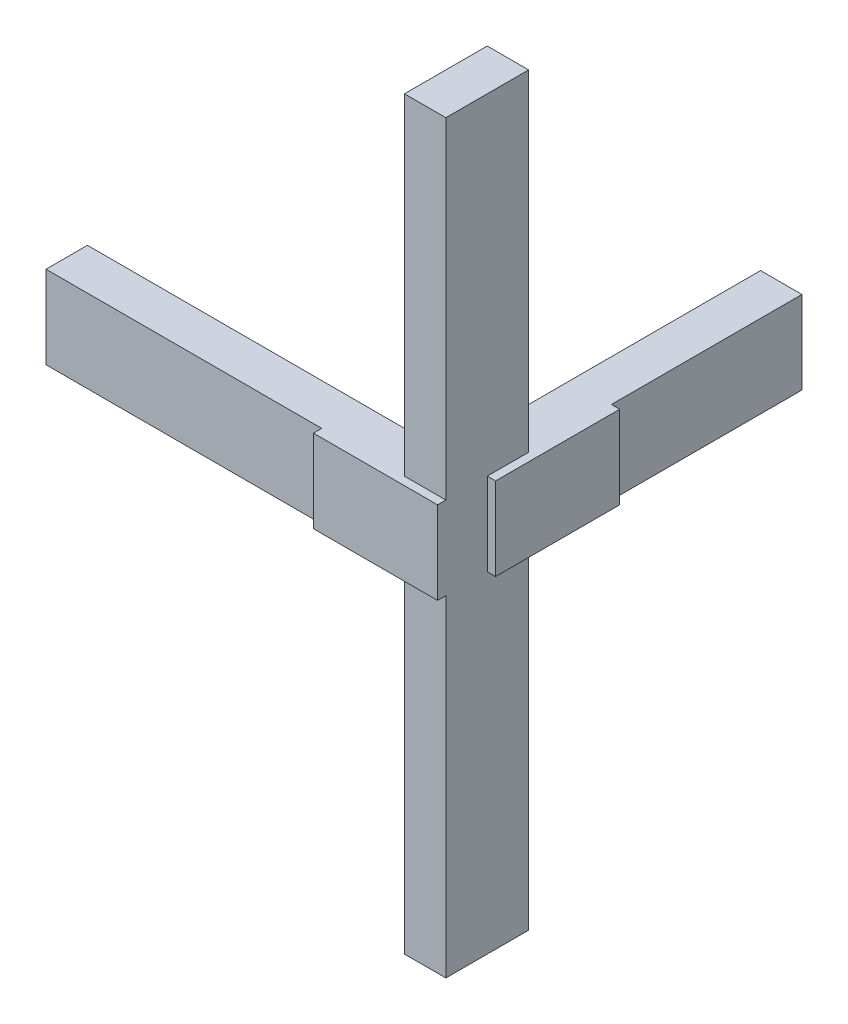
ISO-10303-21;
HEADER;
FILE_DESCRIPTION(('STEP AP214'),'2;1');
FILE_NAME('part.step','',(''),(''),'','','');
FILE_SCHEMA(('AUTOMOTIVE_DESIGN { 1 0 10303 214 1 1 1 1 }'));
ENDSEC;
DATA;
#1=APPLICATION_CONTEXT('core data for automotive mechanical design processes');
#2=APPLICATION_PROTOCOL_DEFINITION('international standard','automotive_design',2000,#1);
#3=PRODUCT_CONTEXT('',#1,'mechanical');
#4=PRODUCT('Part','Part','',(#3));
#5=PRODUCT_RELATED_PRODUCT_CATEGORY('part','',(#4));
#6=PRODUCT_DEFINITION_FORMATION('','',#4);
#7=PRODUCT_DEFINITION_CONTEXT('part definition',#1,'design');
#8=PRODUCT_DEFINITION('design','',#6,#7);
#9=PRODUCT_DEFINITION_SHAPE('','',#8);
#10=(LENGTH_UNIT() NAMED_UNIT(*) SI_UNIT(.MILLI.,.METRE.));
#11=(NAMED_UNIT(*) PLANE_ANGLE_UNIT() SI_UNIT($,.RADIAN.));
#12=(NAMED_UNIT(*) SI_UNIT($,.STERADIAN.) SOLID_ANGLE_UNIT());
#13=UNCERTAINTY_MEASURE_WITH_UNIT(LENGTH_MEASURE(1.E-05),#10,'distance_accuracy_value','');
#14=(GEOMETRIC_REPRESENTATION_CONTEXT(3) GLOBAL_UNCERTAINTY_ASSIGNED_CONTEXT((#13)) GLOBAL_UNIT_ASSIGNED_CONTEXT((#10,
#11,#12)) REPRESENTATION_CONTEXT('',''));
#15=CARTESIAN_POINT('',(0.,0.,0.));
#16=DIRECTION('',(0.,0.,1.));
#17=DIRECTION('',(1.,0.,0.));
#18=AXIS2_PLACEMENT_3D('',#15,#16,#17);
#19=CARTESIAN_POINT('',(0.,40.,0.));
#20=DIRECTION('',(0.,1.,0.));
#21=DIRECTION('',(0.,0.,1.));
#22=AXIS2_PLACEMENT_3D('',#19,#20,#21);
#23=PLANE('',#22);
#24=DIRECTION('',(0.,0.,1.));
#25=VECTOR('',#24,1.);
#26=CARTESIAN_POINT('',(20.,40.,0.));
#27=LINE('',#26,#25);
#28=CARTESIAN_POINT('',(20.,40.,20.));
#29=VERTEX_POINT('',#28);
#30=CARTESIAN_POINT('',(20.,40.,24.));
#31=VERTEX_POINT('',#30);
#32=EDGE_CURVE('E225',#29,#31,#27,.T.);
#33=ORIENTED_EDGE('',*,*,#32,.F.);
#34=DIRECTION('',(-1.,0.,0.));
#35=VECTOR('',#34,1.);
#36=CARTESIAN_POINT('',(0.,40.,20.));
#37=LINE('',#36,#35);
#38=CARTESIAN_POINT('',(0.,40.,20.));
#39=VERTEX_POINT('',#38);
#40=EDGE_CURVE('E175',#29,#39,#37,.T.);
#41=ORIENTED_EDGE('',*,*,#40,.T.);
#42=DIRECTION('',(0.,0.,-1.));
#43=VECTOR('',#42,1.);
#44=CARTESIAN_POINT('',(0.,40.,0.));
#45=LINE('',#44,#43);
#46=CARTESIAN_POINT('',(0.,40.,0.));
#47=VERTEX_POINT('',#46);
#48=EDGE_CURVE('E221',#39,#47,#45,.T.);
#49=ORIENTED_EDGE('',*,*,#48,.T.);
#50=DIRECTION('',(-1.,0.,0.));
#51=VECTOR('',#50,1.);
#52=CARTESIAN_POINT('',(0.,40.,0.));
#53=LINE('',#52,#51);
#54=CARTESIAN_POINT('',(-173.191489361702,40.,0.));
#55=VERTEX_POINT('',#54);
#56=EDGE_CURVE('E245',#47,#55,#53,.T.);
#57=ORIENTED_EDGE('',*,*,#56,.T.);
#58=DIRECTION('',(0.,0.,1.));
#59=VECTOR('',#58,1.);
#60=CARTESIAN_POINT('',(-173.191489361702,40.,0.));
#61=LINE('',#60,#59);
#62=CARTESIAN_POINT('',(-173.191489361702,40.,20.));
#63=VERTEX_POINT('',#62);
#64=EDGE_CURVE('E247',#55,#63,#61,.T.);
#65=ORIENTED_EDGE('',*,*,#64,.T.);
#66=DIRECTION('',(1.,0.,0.));
#67=VECTOR('',#66,1.);
#68=CARTESIAN_POINT('',(0.,40.,20.));
#69=LINE('',#68,#67);
#70=CARTESIAN_POINT('',(-40.,40.,20.));
#71=VERTEX_POINT('',#70);
#72=EDGE_CURVE('E249',#63,#71,#69,.T.);
#73=ORIENTED_EDGE('',*,*,#72,.T.);
#74=DIRECTION('',(0.,0.,-1.));
#75=VECTOR('',#74,1.);
#76=CARTESIAN_POINT('',(-40.0000000000001,40.,1.38777878078145E-13));
#77=LINE('',#76,#75);
#78=CARTESIAN_POINT('',(-40.,40.,24.));
#79=VERTEX_POINT('',#78);
#80=EDGE_CURVE('E251',#79,#71,#77,.T.);
#81=ORIENTED_EDGE('',*,*,#80,.F.);
#82=DIRECTION('',(-1.,0.,0.));
#83=VECTOR('',#82,1.);
#84=CARTESIAN_POINT('',(0.,40.,24.));
#85=LINE('',#84,#83);
#86=EDGE_CURVE('E254',#31,#79,#85,.T.);
#87=ORIENTED_EDGE('',*,*,#86,.F.);
#88=EDGE_LOOP('',(#33,#41,#49,#57,#65,#73,#81,#87));
#89=FACE_BOUND('',#88,.T.);
#90=ADVANCED_FACE('F33',(#89),#23,.T.);
#91=DIRECTION('',(0.,0.,-1.));
#92=VECTOR('',#91,1.);
#93=CARTESIAN_POINT('',(0.,40.,0.));
#94=LINE('',#93,#92);
#95=CARTESIAN_POINT('',(0.,40.,-20.));
#96=VERTEX_POINT('',#95);
#97=CARTESIAN_POINT('',(0.,40.,-152.062590846798));
#98=VERTEX_POINT('',#97);
#99=EDGE_CURVE('E243',#96,#98,#94,.T.);
#100=ORIENTED_EDGE('',*,*,#99,.F.);
#101=DIRECTION('',(1.,0.,0.));
#102=VECTOR('',#101,1.);
#103=CARTESIAN_POINT('',(0.,40.,-20.));
#104=LINE('',#103,#102);
#105=CARTESIAN_POINT('',(20.,40.,-20.));
#106=VERTEX_POINT('',#105);
#107=EDGE_CURVE('E218',#96,#106,#104,.T.);
#108=ORIENTED_EDGE('',*,*,#107,.T.);
#109=DIRECTION('',(0.,0.,1.));
#110=VECTOR('',#109,1.);
#111=CARTESIAN_POINT('',(20.,40.,0.));
#112=LINE('',#111,#110);
#113=CARTESIAN_POINT('',(20.,40.,0.));
#114=VERTEX_POINT('',#113);
#115=EDGE_CURVE('E207',#106,#114,#112,.T.);
#116=ORIENTED_EDGE('',*,*,#115,.T.);
#117=DIRECTION('',(-1.,0.,0.));
#118=VECTOR('',#117,1.);
#119=CARTESIAN_POINT('',(0.,40.,0.));
#120=LINE('',#119,#118);
#121=CARTESIAN_POINT('',(24.,40.,0.));
#122=VERTEX_POINT('',#121);
#123=EDGE_CURVE('E227',#122,#114,#120,.T.);
#124=ORIENTED_EDGE('',*,*,#123,.F.);
#125=DIRECTION('',(0.,0.,1.));
#126=VECTOR('',#125,1.);
#127=CARTESIAN_POINT('',(24.,40.,0.));
#128=LINE('',#127,#126);
#129=CARTESIAN_POINT('',(24.,40.,-60.));
#130=VERTEX_POINT('',#129);
#131=EDGE_CURVE('E231',#130,#122,#128,.T.);
#132=ORIENTED_EDGE('',*,*,#131,.F.);
#133=DIRECTION('',(1.,0.,0.));
#134=VECTOR('',#133,1.);
#135=CARTESIAN_POINT('',(0.,40.,-60.));
#136=LINE('',#135,#134);
#137=CARTESIAN_POINT('',(20.,40.,-60.));
#138=VERTEX_POINT('',#137);
#139=EDGE_CURVE('E234',#138,#130,#136,.T.);
#140=ORIENTED_EDGE('',*,*,#139,.F.);
#141=DIRECTION('',(0.,0.,1.));
#142=VECTOR('',#141,1.);
#143=CARTESIAN_POINT('',(20.,40.,0.));
#144=LINE('',#143,#142);
#145=CARTESIAN_POINT('',(20.,40.,-152.062590846798));
#146=VERTEX_POINT('',#145);
#147=EDGE_CURVE('E237',#146,#138,#144,.T.);
#148=ORIENTED_EDGE('',*,*,#147,.F.);
#149=DIRECTION('',(1.,0.,0.));
#150=VECTOR('',#149,1.);
#151=CARTESIAN_POINT('',(2.11029236927837E-13,40.,-152.062590846798));
#152=LINE('',#151,#150);
#153=EDGE_CURVE('E240',#98,#146,#152,.T.);
#154=ORIENTED_EDGE('',*,*,#153,.F.);
#155=EDGE_LOOP('',(#100,#108,#116,#124,#132,#140,#148,#154));
#156=FACE_BOUND('',#155,.T.);
#157=ADVANCED_FACE('F360',(#156),#23,.T.);
#158=CARTESIAN_POINT('',(0.,0.,0.));
#159=DIRECTION('',(0.,1.,0.));
#160=DIRECTION('',(0.,0.,1.));
#161=AXIS2_PLACEMENT_3D('',#158,#159,#160);
#162=PLANE('',#161);
#163=DIRECTION('',(-1.,0.,0.));
#164=VECTOR('',#163,1.);
#165=CARTESIAN_POINT('',(0.,0.,20.));
#166=LINE('',#165,#164);
#167=CARTESIAN_POINT('',(20.,0.,20.));
#168=VERTEX_POINT('',#167);
#169=CARTESIAN_POINT('',(0.,0.,20.));
#170=VERTEX_POINT('',#169);
#171=EDGE_CURVE('E11',#168,#170,#166,.T.);
#172=ORIENTED_EDGE('',*,*,#171,.F.);
#173=DIRECTION('',(0.,0.,1.));
#174=VECTOR('',#173,1.);
#175=CARTESIAN_POINT('',(20.,0.,0.));
#176=LINE('',#175,#174);
#177=CARTESIAN_POINT('',(20.,0.,24.));
#178=VERTEX_POINT('',#177);
#179=EDGE_CURVE('E224',#168,#178,#176,.T.);
#180=ORIENTED_EDGE('',*,*,#179,.T.);
#181=DIRECTION('',(-1.,0.,0.));
#182=VECTOR('',#181,1.);
#183=CARTESIAN_POINT('',(0.,0.,24.));
#184=LINE('',#183,#182);
#185=CARTESIAN_POINT('',(-40.,0.,24.));
#186=VERTEX_POINT('',#185);
#187=EDGE_CURVE('E228',#178,#186,#184,.T.);
#188=ORIENTED_EDGE('',*,*,#187,.T.);
#189=DIRECTION('',(0.,0.,-1.));
#190=VECTOR('',#189,1.);
#191=CARTESIAN_POINT('',(-40.0000000000001,0.,1.38777878078145E-13));
#192=LINE('',#191,#190);
#193=CARTESIAN_POINT('',(-40.,0.,20.));
#194=VERTEX_POINT('',#193);
#195=EDGE_CURVE('E283',#186,#194,#192,.T.);
#196=ORIENTED_EDGE('',*,*,#195,.T.);
#197=DIRECTION('',(1.,0.,0.));
#198=VECTOR('',#197,1.);
#199=CARTESIAN_POINT('',(0.,0.,20.));
#200=LINE('',#199,#198);
#201=CARTESIAN_POINT('',(-173.191489361702,0.,20.));
#202=VERTEX_POINT('',#201);
#203=EDGE_CURVE('E280',#202,#194,#200,.T.);
#204=ORIENTED_EDGE('',*,*,#203,.F.);
#205=DIRECTION('',(0.,0.,1.));
#206=VECTOR('',#205,1.);
#207=CARTESIAN_POINT('',(-173.191489361702,0.,0.));
#208=LINE('',#207,#206);
#209=CARTESIAN_POINT('',(-173.191489361702,0.,0.));
#210=VERTEX_POINT('',#209);
#211=EDGE_CURVE('E278',#210,#202,#208,.T.);
#212=ORIENTED_EDGE('',*,*,#211,.F.);
#213=DIRECTION('',(-1.,0.,0.));
#214=VECTOR('',#213,1.);
#215=CARTESIAN_POINT('',(0.,0.,0.));
#216=LINE('',#215,#214);
#217=CARTESIAN_POINT('',(0.,0.,0.));
#218=VERTEX_POINT('',#217);
#219=EDGE_CURVE('E276',#218,#210,#216,.T.);
#220=ORIENTED_EDGE('',*,*,#219,.F.);
#221=DIRECTION('',(0.,0.,-1.));
#222=VECTOR('',#221,1.);
#223=CARTESIAN_POINT('',(0.,0.,0.));
#224=LINE('',#223,#222);
#225=EDGE_CURVE('E41',#170,#218,#224,.T.);
#226=ORIENTED_EDGE('',*,*,#225,.F.);
#227=EDGE_LOOP('',(#172,#180,#188,#196,#204,#212,#220,#226));
#228=FACE_BOUND('',#227,.T.);
#229=ADVANCED_FACE('F331',(#228),#162,.F.);
#230=DIRECTION('',(1.,0.,0.));
#231=VECTOR('',#230,1.);
#232=CARTESIAN_POINT('',(0.,0.,-20.));
#233=LINE('',#232,#231);
#234=CARTESIAN_POINT('',(0.,0.,-20.));
#235=VERTEX_POINT('',#234);
#236=CARTESIAN_POINT('',(20.,0.,-20.));
#237=VERTEX_POINT('',#236);
#238=EDGE_CURVE('E318',#235,#237,#233,.T.);
#239=ORIENTED_EDGE('',*,*,#238,.F.);
#240=DIRECTION('',(0.,0.,-1.));
#241=VECTOR('',#240,1.);
#242=CARTESIAN_POINT('',(0.,0.,0.));
#243=LINE('',#242,#241);
#244=CARTESIAN_POINT('',(0.,0.,-152.062590846798));
#245=VERTEX_POINT('',#244);
#246=EDGE_CURVE('E274',#235,#245,#243,.T.);
#247=ORIENTED_EDGE('',*,*,#246,.T.);
#248=DIRECTION('',(1.,0.,0.));
#249=VECTOR('',#248,1.);
#250=CARTESIAN_POINT('',(2.11029236927837E-13,0.,-152.062590846798));
#251=LINE('',#250,#249);
#252=CARTESIAN_POINT('',(20.,0.,-152.062590846798));
#253=VERTEX_POINT('',#252);
#254=EDGE_CURVE('E271',#245,#253,#251,.T.);
#255=ORIENTED_EDGE('',*,*,#254,.T.);
#256=DIRECTION('',(0.,0.,1.));
#257=VECTOR('',#256,1.);
#258=CARTESIAN_POINT('',(20.,0.,0.));
#259=LINE('',#258,#257);
#260=CARTESIAN_POINT('',(20.,0.,-60.));
#261=VERTEX_POINT('',#260);
#262=EDGE_CURVE('E268',#253,#261,#259,.T.);
#263=ORIENTED_EDGE('',*,*,#262,.T.);
#264=DIRECTION('',(1.,0.,0.));
#265=VECTOR('',#264,1.);
#266=CARTESIAN_POINT('',(0.,0.,-60.));
#267=LINE('',#266,#265);
#268=CARTESIAN_POINT('',(24.,0.,-60.));
#269=VERTEX_POINT('',#268);
#270=EDGE_CURVE('E265',#261,#269,#267,.T.);
#271=ORIENTED_EDGE('',*,*,#270,.T.);
#272=DIRECTION('',(0.,0.,1.));
#273=VECTOR('',#272,1.);
#274=CARTESIAN_POINT('',(24.,0.,0.));
#275=LINE('',#274,#273);
#276=CARTESIAN_POINT('',(24.,0.,0.));
#277=VERTEX_POINT('',#276);
#278=EDGE_CURVE('E262',#269,#277,#275,.T.);
#279=ORIENTED_EDGE('',*,*,#278,.T.);
#280=DIRECTION('',(-1.,0.,0.));
#281=VECTOR('',#280,1.);
#282=CARTESIAN_POINT('',(0.,0.,0.));
#283=LINE('',#282,#281);
#284=CARTESIAN_POINT('',(20.,0.,0.));
#285=VERTEX_POINT('',#284);
#286=EDGE_CURVE('E259',#277,#285,#283,.T.);
#287=ORIENTED_EDGE('',*,*,#286,.T.);
#288=DIRECTION('',(0.,0.,1.));
#289=VECTOR('',#288,1.);
#290=CARTESIAN_POINT('',(20.,0.,0.));
#291=LINE('',#290,#289);
#292=EDGE_CURVE('E315',#237,#285,#291,.T.);
#293=ORIENTED_EDGE('',*,*,#292,.F.);
#294=EDGE_LOOP('',(#239,#247,#255,#263,#271,#279,#287,#293));
#295=FACE_BOUND('',#294,.T.);
#296=ADVANCED_FACE('F377',(#295),#162,.F.);
#297=CARTESIAN_POINT('',(20.,40.,0.));
#298=DIRECTION('',(1.,0.,0.));
#299=DIRECTION('',(0.,0.,-1.));
#300=AXIS2_PLACEMENT_3D('',#297,#298,#299);
#301=PLANE('',#300);
#302=DIRECTION('',(0.,1.,0.));
#303=VECTOR('',#302,1.);
#304=CARTESIAN_POINT('',(20.,-160.,20.));
#305=LINE('',#304,#303);
#306=CARTESIAN_POINT('',(20.,200.,20.));
#307=VERTEX_POINT('',#306);
#308=EDGE_CURVE('E48',#29,#307,#305,.T.);
#309=ORIENTED_EDGE('',*,*,#308,.F.);
#310=ORIENTED_EDGE('',*,*,#32,.T.);
#311=DIRECTION('',(0.,-1.,0.));
#312=VECTOR('',#311,1.);
#313=CARTESIAN_POINT('',(20.,40.,24.));
#314=LINE('',#313,#312);
#315=EDGE_CURVE('E257',#31,#178,#314,.T.);
#316=ORIENTED_EDGE('',*,*,#315,.T.);
#317=ORIENTED_EDGE('',*,*,#179,.F.);
#318=CARTESIAN_POINT('',(20.,-160.,20.));
#319=VERTEX_POINT('',#318);
#320=EDGE_CURVE('E177',#319,#168,#305,.T.);
#321=ORIENTED_EDGE('',*,*,#320,.F.);
#322=DIRECTION('',(0.,0.,1.));
#323=VECTOR('',#322,1.);
#324=CARTESIAN_POINT('',(20.,-160.,0.));
#325=LINE('',#324,#323);
#326=CARTESIAN_POINT('',(20.,-160.,-20.));
#327=VERTEX_POINT('',#326);
#328=EDGE_CURVE('E199',#327,#319,#325,.T.);
#329=ORIENTED_EDGE('',*,*,#328,.F.);
#330=DIRECTION('',(0.,1.,0.));
#331=VECTOR('',#330,1.);
#332=CARTESIAN_POINT('',(20.,-160.,-20.));
#333=LINE('',#332,#331);
#334=EDGE_CURVE('E213',#327,#237,#333,.T.);
#335=ORIENTED_EDGE('',*,*,#334,.T.);
#336=ORIENTED_EDGE('',*,*,#292,.T.);
#337=DIRECTION('',(0.,-1.,0.));
#338=VECTOR('',#337,1.);
#339=CARTESIAN_POINT('',(20.,40.,0.));
#340=LINE('',#339,#338);
#341=EDGE_CURVE('E313',#114,#285,#340,.T.);
#342=ORIENTED_EDGE('',*,*,#341,.F.);
#343=ORIENTED_EDGE('',*,*,#115,.F.);
#344=CARTESIAN_POINT('',(20.,200.,-20.));
#345=VERTEX_POINT('',#344);
#346=EDGE_CURVE('E190',#106,#345,#333,.T.);
#347=ORIENTED_EDGE('',*,*,#346,.T.);
#348=DIRECTION('',(0.,0.,1.));
#349=VECTOR('',#348,1.);
#350=CARTESIAN_POINT('',(20.,200.,0.));
#351=LINE('',#350,#349);
#352=EDGE_CURVE('E184',#345,#307,#351,.T.);
#353=ORIENTED_EDGE('',*,*,#352,.T.);
#354=EDGE_LOOP('',(#309,#310,#316,#317,#321,#329,#335,#336,#342,#343,#347,#353));
#355=FACE_BOUND('',#354,.T.);
#356=ADVANCED_FACE('F35',(#355),#301,.T.);
#357=CARTESIAN_POINT('',(0.,40.,0.));
#358=DIRECTION('',(0.,0.,1.));
#359=DIRECTION('',(1.,0.,0.));
#360=AXIS2_PLACEMENT_3D('',#357,#358,#359);
#361=PLANE('',#360);
#362=ORIENTED_EDGE('',*,*,#286,.F.);
#363=DIRECTION('',(0.,-1.,0.));
#364=VECTOR('',#363,1.);
#365=CARTESIAN_POINT('',(24.,40.,0.));
#366=LINE('',#365,#364);
#367=EDGE_CURVE('E311',#122,#277,#366,.T.);
#368=ORIENTED_EDGE('',*,*,#367,.F.);
#369=ORIENTED_EDGE('',*,*,#123,.T.);
#370=ORIENTED_EDGE('',*,*,#341,.T.);
#371=EDGE_LOOP('',(#362,#368,#369,#370));
#372=FACE_BOUND('',#371,.T.);
#373=ADVANCED_FACE('F381',(#372),#361,.T.);
#374=CARTESIAN_POINT('',(24.,40.,0.));
#375=DIRECTION('',(1.,0.,0.));
#376=DIRECTION('',(0.,0.,-1.));
#377=AXIS2_PLACEMENT_3D('',#374,#375,#376);
#378=PLANE('',#377);
#379=ORIENTED_EDGE('',*,*,#278,.F.);
#380=DIRECTION('',(0.,-1.,0.));
#381=VECTOR('',#380,1.);
#382=CARTESIAN_POINT('',(24.,40.,-60.));
#383=LINE('',#382,#381);
#384=EDGE_CURVE('E309',#130,#269,#383,.T.);
#385=ORIENTED_EDGE('',*,*,#384,.F.);
#386=ORIENTED_EDGE('',*,*,#131,.T.);
#387=ORIENTED_EDGE('',*,*,#367,.T.);
#388=EDGE_LOOP('',(#379,#385,#386,#387));
#389=FACE_BOUND('',#388,.T.);
#390=ADVANCED_FACE('F385',(#389),#378,.T.);
#391=CARTESIAN_POINT('',(0.,40.,-60.));
#392=DIRECTION('',(0.,0.,-1.));
#393=DIRECTION('',(-1.,0.,0.));
#394=AXIS2_PLACEMENT_3D('',#391,#392,#393);
#395=PLANE('',#394);
#396=ORIENTED_EDGE('',*,*,#270,.F.);
#397=DIRECTION('',(0.,-1.,0.));
#398=VECTOR('',#397,1.);
#399=CARTESIAN_POINT('',(20.,40.,-60.));
#400=LINE('',#399,#398);
#401=EDGE_CURVE('E307',#138,#261,#400,.T.);
#402=ORIENTED_EDGE('',*,*,#401,.F.);
#403=ORIENTED_EDGE('',*,*,#139,.T.);
#404=ORIENTED_EDGE('',*,*,#384,.T.);
#405=EDGE_LOOP('',(#396,#402,#403,#404));
#406=FACE_BOUND('',#405,.T.);
#407=ADVANCED_FACE('F388',(#406),#395,.T.);
#408=CARTESIAN_POINT('',(20.,40.,0.));
#409=DIRECTION('',(1.,0.,0.));
#410=DIRECTION('',(0.,0.,-1.));
#411=AXIS2_PLACEMENT_3D('',#408,#409,#410);
#412=PLANE('',#411);
#413=ORIENTED_EDGE('',*,*,#262,.F.);
#414=DIRECTION('',(0.,-1.,0.));
#415=VECTOR('',#414,1.);
#416=CARTESIAN_POINT('',(20.,40.,-152.062590846798));
#417=LINE('',#416,#415);
#418=EDGE_CURVE('E305',#146,#253,#417,.T.);
#419=ORIENTED_EDGE('',*,*,#418,.F.);
#420=ORIENTED_EDGE('',*,*,#147,.T.);
#421=ORIENTED_EDGE('',*,*,#401,.T.);
#422=EDGE_LOOP('',(#413,#419,#420,#421));
#423=FACE_BOUND('',#422,.T.);
#424=ADVANCED_FACE('F390',(#423),#412,.T.);
#425=CARTESIAN_POINT('',(2.11029236927837E-13,40.,-152.062590846798));
#426=DIRECTION('',(0.,0.,-1.));
#427=DIRECTION('',(-1.,0.,0.));
#428=AXIS2_PLACEMENT_3D('',#425,#426,#427);
#429=PLANE('',#428);
#430=ORIENTED_EDGE('',*,*,#254,.F.);
#431=DIRECTION('',(0.,-1.,0.));
#432=VECTOR('',#431,1.);
#433=CARTESIAN_POINT('',(0.,40.,-152.062590846798));
#434=LINE('',#433,#432);
#435=EDGE_CURVE('E302',#98,#245,#434,.T.);
#436=ORIENTED_EDGE('',*,*,#435,.F.);
#437=ORIENTED_EDGE('',*,*,#153,.T.);
#438=ORIENTED_EDGE('',*,*,#418,.T.);
#439=EDGE_LOOP('',(#430,#436,#437,#438));
#440=FACE_BOUND('',#439,.T.);
#441=ADVANCED_FACE('F365',(#440),#429,.T.);
#442=CARTESIAN_POINT('',(0.,40.,0.));
#443=DIRECTION('',(-1.,0.,0.));
#444=DIRECTION('',(0.,0.,1.));
#445=AXIS2_PLACEMENT_3D('',#442,#443,#444);
#446=PLANE('',#445);
#447=DIRECTION('',(0.,1.,0.));
#448=VECTOR('',#447,1.);
#449=CARTESIAN_POINT('',(0.,-160.,-20.));
#450=LINE('',#449,#448);
#451=CARTESIAN_POINT('',(0.,200.,-20.));
#452=VERTEX_POINT('',#451);
#453=EDGE_CURVE('E212',#96,#452,#450,.T.);
#454=ORIENTED_EDGE('',*,*,#453,.F.);
#455=ORIENTED_EDGE('',*,*,#99,.T.);
#456=ORIENTED_EDGE('',*,*,#435,.T.);
#457=ORIENTED_EDGE('',*,*,#246,.F.);
#458=CARTESIAN_POINT('',(0.,-160.,-20.));
#459=VERTEX_POINT('',#458);
#460=EDGE_CURVE('E209',#459,#235,#450,.T.);
#461=ORIENTED_EDGE('',*,*,#460,.F.);
#462=DIRECTION('',(0.,0.,-1.));
#463=VECTOR('',#462,1.);
#464=CARTESIAN_POINT('',(0.,-160.,0.));
#465=LINE('',#464,#463);
#466=CARTESIAN_POINT('',(0.,-160.,20.));
#467=VERTEX_POINT('',#466);
#468=EDGE_CURVE('E178',#467,#459,#465,.T.);
#469=ORIENTED_EDGE('',*,*,#468,.F.);
#470=DIRECTION('',(0.,1.,0.));
#471=VECTOR('',#470,1.);
#472=CARTESIAN_POINT('',(0.,-160.,20.));
#473=LINE('',#472,#471);
#474=EDGE_CURVE('E204',#467,#170,#473,.T.);
#475=ORIENTED_EDGE('',*,*,#474,.T.);
#476=ORIENTED_EDGE('',*,*,#225,.T.);
#477=DIRECTION('',(0.,-1.,0.));
#478=VECTOR('',#477,1.);
#479=CARTESIAN_POINT('',(0.,40.,0.));
#480=LINE('',#479,#478);
#481=EDGE_CURVE('E300',#47,#218,#480,.T.);
#482=ORIENTED_EDGE('',*,*,#481,.F.);
#483=ORIENTED_EDGE('',*,*,#48,.F.);
#484=CARTESIAN_POINT('',(0.,200.,20.));
#485=VERTEX_POINT('',#484);
#486=EDGE_CURVE('E208',#39,#485,#473,.T.);
#487=ORIENTED_EDGE('',*,*,#486,.T.);
#488=DIRECTION('',(0.,0.,-1.));
#489=VECTOR('',#488,1.);
#490=CARTESIAN_POINT('',(0.,200.,0.));
#491=LINE('',#490,#489);
#492=EDGE_CURVE('E187',#485,#452,#491,.T.);
#493=ORIENTED_EDGE('',*,*,#492,.T.);
#494=EDGE_LOOP('',(#454,#455,#456,#457,#461,#469,#475,#476,#482,#483,#487,#493));
#495=FACE_BOUND('',#494,.T.);
#496=ADVANCED_FACE('F323',(#495),#446,.T.);
#497=CARTESIAN_POINT('',(0.,40.,0.));
#498=DIRECTION('',(0.,0.,1.));
#499=DIRECTION('',(1.,0.,0.));
#500=AXIS2_PLACEMENT_3D('',#497,#498,#499);
#501=PLANE('',#500);
#502=ORIENTED_EDGE('',*,*,#219,.T.);
#503=DIRECTION('',(0.,-1.,0.));
#504=VECTOR('',#503,1.);
#505=CARTESIAN_POINT('',(-173.191489361702,40.,0.));
#506=LINE('',#505,#504);
#507=EDGE_CURVE('E297',#55,#210,#506,.T.);
#508=ORIENTED_EDGE('',*,*,#507,.F.);
#509=ORIENTED_EDGE('',*,*,#56,.F.);
#510=ORIENTED_EDGE('',*,*,#481,.T.);
#511=EDGE_LOOP('',(#502,#508,#509,#510));
#512=FACE_BOUND('',#511,.T.);
#513=ADVANCED_FACE('F353',(#512),#501,.F.);
#514=CARTESIAN_POINT('',(-173.191489361702,40.,0.));
#515=DIRECTION('',(1.,0.,0.));
#516=DIRECTION('',(0.,0.,-1.));
#517=AXIS2_PLACEMENT_3D('',#514,#515,#516);
#518=PLANE('',#517);
#519=ORIENTED_EDGE('',*,*,#211,.T.);
#520=DIRECTION('',(0.,-1.,0.));
#521=VECTOR('',#520,1.);
#522=CARTESIAN_POINT('',(-173.191489361702,40.,20.));
#523=LINE('',#522,#521);
#524=EDGE_CURVE('E294',#63,#202,#523,.T.);
#525=ORIENTED_EDGE('',*,*,#524,.F.);
#526=ORIENTED_EDGE('',*,*,#64,.F.);
#527=ORIENTED_EDGE('',*,*,#507,.T.);
#528=EDGE_LOOP('',(#519,#525,#526,#527));
#529=FACE_BOUND('',#528,.T.);
#530=ADVANCED_FACE('F350',(#529),#518,.F.);
#531=CARTESIAN_POINT('',(0.,40.,20.));
#532=DIRECTION('',(0.,0.,-1.));
#533=DIRECTION('',(-1.,0.,0.));
#534=AXIS2_PLACEMENT_3D('',#531,#532,#533);
#535=PLANE('',#534);
#536=ORIENTED_EDGE('',*,*,#203,.T.);
#537=DIRECTION('',(0.,-1.,0.));
#538=VECTOR('',#537,1.);
#539=CARTESIAN_POINT('',(-40.,40.,20.));
#540=LINE('',#539,#538);
#541=EDGE_CURVE('E292',#71,#194,#540,.T.);
#542=ORIENTED_EDGE('',*,*,#541,.F.);
#543=ORIENTED_EDGE('',*,*,#72,.F.);
#544=ORIENTED_EDGE('',*,*,#524,.T.);
#545=EDGE_LOOP('',(#536,#542,#543,#544));
#546=FACE_BOUND('',#545,.T.);
#547=ADVANCED_FACE('F345',(#546),#535,.F.);
#548=CARTESIAN_POINT('',(-40.0000000000001,40.,1.38777878078145E-13));
#549=DIRECTION('',(-1.,0.,0.));
#550=DIRECTION('',(0.,0.,1.));
#551=AXIS2_PLACEMENT_3D('',#548,#549,#550);
#552=PLANE('',#551);
#553=ORIENTED_EDGE('',*,*,#195,.F.);
#554=DIRECTION('',(0.,-1.,0.));
#555=VECTOR('',#554,1.);
#556=CARTESIAN_POINT('',(-40.,40.,24.));
#557=LINE('',#556,#555);
#558=EDGE_CURVE('E290',#79,#186,#557,.T.);
#559=ORIENTED_EDGE('',*,*,#558,.F.);
#560=ORIENTED_EDGE('',*,*,#80,.T.);
#561=ORIENTED_EDGE('',*,*,#541,.T.);
#562=EDGE_LOOP('',(#553,#559,#560,#561));
#563=FACE_BOUND('',#562,.T.);
#564=ADVANCED_FACE('F340',(#563),#552,.T.);
#565=CARTESIAN_POINT('',(0.,40.,24.));
#566=DIRECTION('',(0.,0.,1.));
#567=DIRECTION('',(1.,0.,0.));
#568=AXIS2_PLACEMENT_3D('',#565,#566,#567);
#569=PLANE('',#568);
#570=ORIENTED_EDGE('',*,*,#187,.F.);
#571=ORIENTED_EDGE('',*,*,#315,.F.);
#572=ORIENTED_EDGE('',*,*,#86,.T.);
#573=ORIENTED_EDGE('',*,*,#558,.T.);
#574=EDGE_LOOP('',(#570,#571,#572,#573));
#575=FACE_BOUND('',#574,.T.);
#576=ADVANCED_FACE('F336',(#575),#569,.T.);
#577=CARTESIAN_POINT('',(0.,-160.,0.));
#578=DIRECTION('',(0.,1.,0.));
#579=DIRECTION('',(0.,0.,1.));
#580=AXIS2_PLACEMENT_3D('',#577,#578,#579);
#581=PLANE('',#580);
#582=DIRECTION('',(-1.,0.,0.));
#583=VECTOR('',#582,1.);
#584=CARTESIAN_POINT('',(0.,-160.,20.));
#585=LINE('',#584,#583);
#586=EDGE_CURVE('E196',#319,#467,#585,.T.);
#587=ORIENTED_EDGE('',*,*,#586,.T.);
#588=ORIENTED_EDGE('',*,*,#468,.T.);
#589=DIRECTION('',(1.,0.,0.));
#590=VECTOR('',#589,1.);
#591=CARTESIAN_POINT('',(0.,-160.,-20.));
#592=LINE('',#591,#590);
#593=EDGE_CURVE('E201',#459,#327,#592,.T.);
#594=ORIENTED_EDGE('',*,*,#593,.T.);
#595=ORIENTED_EDGE('',*,*,#328,.T.);
#596=EDGE_LOOP('',(#587,#588,#594,#595));
#597=FACE_BOUND('',#596,.T.);
#598=ADVANCED_FACE('F375',(#597),#581,.F.);
#599=CARTESIAN_POINT('',(0.,-160.,-20.));
#600=DIRECTION('',(0.,0.,1.));
#601=DIRECTION('',(1.,0.,0.));
#602=AXIS2_PLACEMENT_3D('',#599,#600,#601);
#603=PLANE('',#602);
#604=ORIENTED_EDGE('',*,*,#460,.T.);
#605=ORIENTED_EDGE('',*,*,#238,.T.);
#606=ORIENTED_EDGE('',*,*,#334,.F.);
#607=ORIENTED_EDGE('',*,*,#593,.F.);
#608=EDGE_LOOP('',(#604,#605,#606,#607));
#609=FACE_BOUND('',#608,.T.);
#610=ADVANCED_FACE('F371',(#609),#603,.F.);
#611=CARTESIAN_POINT('',(0.,-160.,20.));
#612=DIRECTION('',(0.,0.,-1.));
#613=DIRECTION('',(-1.,0.,0.));
#614=AXIS2_PLACEMENT_3D('',#611,#612,#613);
#615=PLANE('',#614);
#616=ORIENTED_EDGE('',*,*,#320,.T.);
#617=ORIENTED_EDGE('',*,*,#171,.T.);
#618=ORIENTED_EDGE('',*,*,#474,.F.);
#619=ORIENTED_EDGE('',*,*,#586,.F.);
#620=EDGE_LOOP('',(#616,#617,#618,#619));
#621=FACE_BOUND('',#620,.T.);
#622=ADVANCED_FACE('F329',(#621),#615,.F.);
#623=ORIENTED_EDGE('',*,*,#40,.F.);
#624=ORIENTED_EDGE('',*,*,#308,.T.);
#625=DIRECTION('',(-1.,0.,0.));
#626=VECTOR('',#625,1.);
#627=CARTESIAN_POINT('',(0.,200.,20.));
#628=LINE('',#627,#626);
#629=EDGE_CURVE('E172',#307,#485,#628,.T.);
#630=ORIENTED_EDGE('',*,*,#629,.T.);
#631=ORIENTED_EDGE('',*,*,#486,.F.);
#632=EDGE_LOOP('',(#623,#624,#630,#631));
#633=FACE_BOUND('',#632,.T.);
#634=ADVANCED_FACE('F170',(#633),#615,.F.);
#635=ORIENTED_EDGE('',*,*,#107,.F.);
#636=ORIENTED_EDGE('',*,*,#453,.T.);
#637=DIRECTION('',(1.,0.,0.));
#638=VECTOR('',#637,1.);
#639=CARTESIAN_POINT('',(0.,200.,-20.));
#640=LINE('',#639,#638);
#641=EDGE_CURVE('E191',#452,#345,#640,.T.);
#642=ORIENTED_EDGE('',*,*,#641,.T.);
#643=ORIENTED_EDGE('',*,*,#346,.F.);
#644=EDGE_LOOP('',(#635,#636,#642,#643));
#645=FACE_BOUND('',#644,.T.);
#646=ADVANCED_FACE('F457',(#645),#603,.F.);
#647=CARTESIAN_POINT('',(0.,200.,0.));
#648=DIRECTION('',(0.,1.,0.));
#649=DIRECTION('',(0.,0.,1.));
#650=AXIS2_PLACEMENT_3D('',#647,#648,#649);
#651=PLANE('',#650);
#652=ORIENTED_EDGE('',*,*,#629,.F.);
#653=ORIENTED_EDGE('',*,*,#352,.F.);
#654=ORIENTED_EDGE('',*,*,#641,.F.);
#655=ORIENTED_EDGE('',*,*,#492,.F.);
#656=EDGE_LOOP('',(#652,#653,#654,#655));
#657=FACE_BOUND('',#656,.T.);
#658=ADVANCED_FACE('F182',(#657),#651,.T.);
#659=CLOSED_SHELL('',(#90,#157,#229,#296,#356,#373,#390,#407,#424,#441,#496,#513,#530,#547,#564,
#576,#598,#610,#622,#634,#646,#658));
#660=MANIFOLD_SOLID_BREP('B2',#659);
#661=ADVANCED_BREP_SHAPE_REPRESENTATION('',(#18,#660),#14);
#662=SHAPE_DEFINITION_REPRESENTATION(#9,#661);
ENDSEC;
END-ISO-10303-21;
